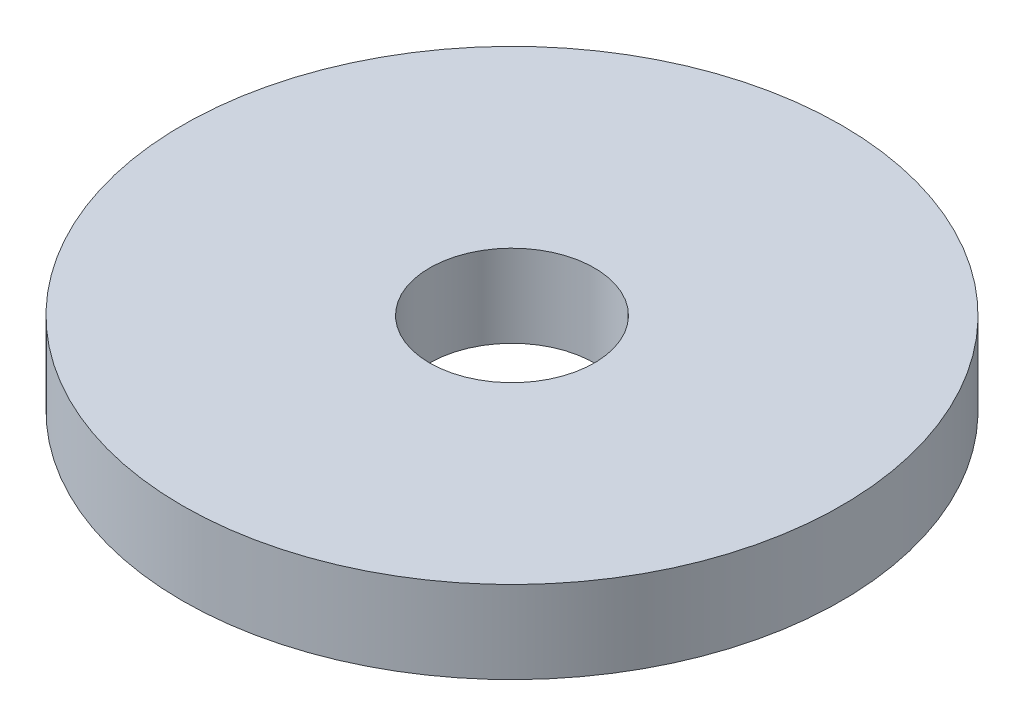
ISO-10303-21;
HEADER;
FILE_DESCRIPTION(('STEP AP214'),'2;1');
FILE_NAME('part.step','',(''),(''),'','','');
FILE_SCHEMA(('AUTOMOTIVE_DESIGN { 1 0 10303 214 1 1 1 1 }'));
ENDSEC;
DATA;
#1=APPLICATION_CONTEXT('core data for automotive mechanical design processes');
#2=APPLICATION_PROTOCOL_DEFINITION('international standard','automotive_design',2000,#1);
#3=PRODUCT_CONTEXT('',#1,'mechanical');
#4=PRODUCT('Part','Part','',(#3));
#5=PRODUCT_RELATED_PRODUCT_CATEGORY('part','',(#4));
#6=PRODUCT_DEFINITION_FORMATION('','',#4);
#7=PRODUCT_DEFINITION_CONTEXT('part definition',#1,'design');
#8=PRODUCT_DEFINITION('design','',#6,#7);
#9=PRODUCT_DEFINITION_SHAPE('','',#8);
#10=(LENGTH_UNIT() NAMED_UNIT(*) SI_UNIT(.MILLI.,.METRE.));
#11=(NAMED_UNIT(*) PLANE_ANGLE_UNIT() SI_UNIT($,.RADIAN.));
#12=(NAMED_UNIT(*) SI_UNIT($,.STERADIAN.) SOLID_ANGLE_UNIT());
#13=UNCERTAINTY_MEASURE_WITH_UNIT(LENGTH_MEASURE(1.E-05),#10,'distance_accuracy_value','');
#14=(GEOMETRIC_REPRESENTATION_CONTEXT(3) GLOBAL_UNCERTAINTY_ASSIGNED_CONTEXT((#13)) GLOBAL_UNIT_ASSIGNED_CONTEXT((#10,
#11,#12)) REPRESENTATION_CONTEXT('',''));
#15=CARTESIAN_POINT('',(0.,0.,0.));
#16=DIRECTION('',(0.,0.,1.));
#17=DIRECTION('',(1.,0.,0.));
#18=AXIS2_PLACEMENT_3D('',#15,#16,#17);
#19=CARTESIAN_POINT('',(0.,5.,0.));
#20=DIRECTION('',(0.,1.,0.));
#21=DIRECTION('',(0.,0.,1.));
#22=AXIS2_PLACEMENT_3D('',#19,#20,#21);
#23=PLANE('',#22);
#24=CARTESIAN_POINT('',(0.,5.,0.));
#25=DIRECTION('',(0.,1.,0.));
#26=DIRECTION('',(0.,0.,1.));
#27=AXIS2_PLACEMENT_3D('',#24,#25,#26);
#28=CIRCLE('',#27,20.);
#29=CARTESIAN_POINT('',(0.,5.,20.));
#30=VERTEX_POINT('',#29);
#31=EDGE_CURVE('E10',#30,#30,#28,.T.);
#32=ORIENTED_EDGE('',*,*,#31,.T.);
#33=EDGE_LOOP('',(#32));
#34=FACE_BOUND('',#33,.T.);
#35=CARTESIAN_POINT('',(0.,5.,0.));
#36=DIRECTION('',(0.,1.,0.));
#37=DIRECTION('',(0.,0.,1.));
#38=AXIS2_PLACEMENT_3D('',#35,#36,#37);
#39=CIRCLE('',#38,5.);
#40=CARTESIAN_POINT('',(0.,5.,5.));
#41=VERTEX_POINT('',#40);
#42=EDGE_CURVE('E42',#41,#41,#39,.T.);
#43=ORIENTED_EDGE('',*,*,#42,.F.);
#44=EDGE_LOOP('',(#43));
#45=FACE_BOUND('',#44,.T.);
#46=ADVANCED_FACE('F31',(#34,#45),#23,.T.);
#47=CARTESIAN_POINT('',(0.,0.,0.));
#48=DIRECTION('',(0.,1.,0.));
#49=DIRECTION('',(0.,0.,1.));
#50=AXIS2_PLACEMENT_3D('',#47,#48,#49);
#51=PLANE('',#50);
#52=CARTESIAN_POINT('',(0.,0.,0.));
#53=DIRECTION('',(0.,1.,0.));
#54=DIRECTION('',(0.,0.,1.));
#55=AXIS2_PLACEMENT_3D('',#52,#53,#54);
#56=CIRCLE('',#55,20.);
#57=CARTESIAN_POINT('',(0.,0.,20.));
#58=VERTEX_POINT('',#57);
#59=EDGE_CURVE('E35',#58,#58,#56,.T.);
#60=ORIENTED_EDGE('',*,*,#59,.F.);
#61=EDGE_LOOP('',(#60));
#62=FACE_BOUND('',#61,.T.);
#63=CARTESIAN_POINT('',(0.,0.,0.));
#64=DIRECTION('',(0.,1.,0.));
#65=DIRECTION('',(0.,0.,1.));
#66=AXIS2_PLACEMENT_3D('',#63,#64,#65);
#67=CIRCLE('',#66,5.);
#68=CARTESIAN_POINT('',(0.,0.,5.));
#69=VERTEX_POINT('',#68);
#70=EDGE_CURVE('E44',#69,#69,#67,.T.);
#71=ORIENTED_EDGE('',*,*,#70,.T.);
#72=EDGE_LOOP('',(#71));
#73=FACE_BOUND('',#72,.T.);
#74=ADVANCED_FACE('F54',(#62,#73),#51,.F.);
#75=CARTESIAN_POINT('',(0.,5.,0.));
#76=DIRECTION('',(0.,-1.,0.));
#77=DIRECTION('',(0.,0.,-1.));
#78=AXIS2_PLACEMENT_3D('',#75,#76,#77);
#79=CYLINDRICAL_SURFACE('',#78,20.);
#80=ORIENTED_EDGE('',*,*,#31,.F.);
#81=EDGE_LOOP('',(#80));
#82=FACE_BOUND('',#81,.T.);
#83=ORIENTED_EDGE('',*,*,#59,.T.);
#84=EDGE_LOOP('',(#83));
#85=FACE_BOUND('',#84,.T.);
#86=ADVANCED_FACE('F33',(#82,#85),#79,.T.);
#87=CARTESIAN_POINT('',(0.,5.,0.));
#88=DIRECTION('',(0.,-1.,0.));
#89=DIRECTION('',(0.,0.,-1.));
#90=AXIS2_PLACEMENT_3D('',#87,#88,#89);
#91=CYLINDRICAL_SURFACE('',#90,5.);
#92=ORIENTED_EDGE('',*,*,#42,.T.);
#93=EDGE_LOOP('',(#92));
#94=FACE_BOUND('',#93,.T.);
#95=ORIENTED_EDGE('',*,*,#70,.F.);
#96=EDGE_LOOP('',(#95));
#97=FACE_BOUND('',#96,.T.);
#98=ADVANCED_FACE('F50',(#94,#97),#91,.F.);
#99=CLOSED_SHELL('',(#46,#74,#86,#98));
#100=MANIFOLD_SOLID_BREP('B2',#99);
#101=ADVANCED_BREP_SHAPE_REPRESENTATION('',(#18,#100),#14);
#102=SHAPE_DEFINITION_REPRESENTATION(#9,#101);
ENDSEC;
END-ISO-10303-21;
